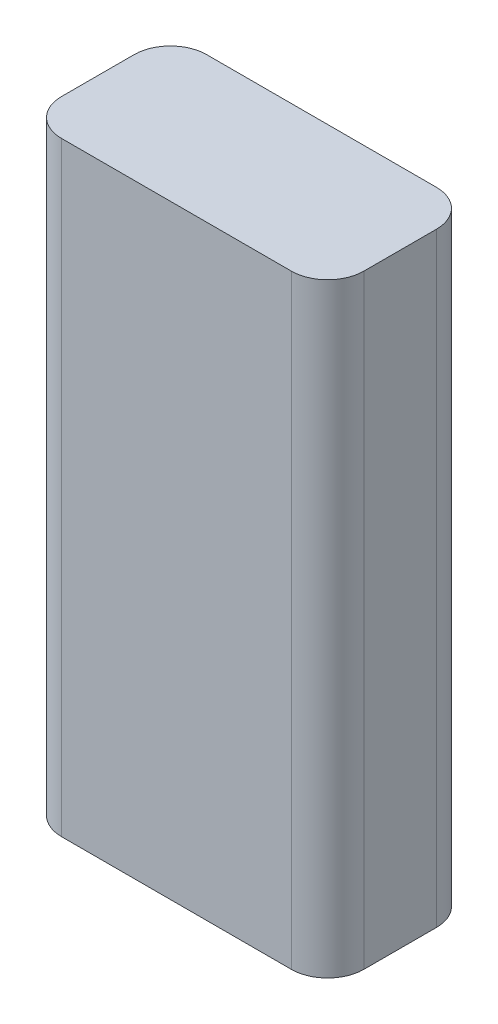
ISO-10303-21;
HEADER;
FILE_DESCRIPTION(('STEP AP214'),'2;1');
FILE_NAME('part.step','',(''),(''),'','','');
FILE_SCHEMA(('AUTOMOTIVE_DESIGN { 1 0 10303 214 1 1 1 1 }'));
ENDSEC;
DATA;
#1=APPLICATION_CONTEXT('core data for automotive mechanical design processes');
#2=APPLICATION_PROTOCOL_DEFINITION('international standard','automotive_design',2000,#1);
#3=PRODUCT_CONTEXT('',#1,'mechanical');
#4=PRODUCT('Part','Part','',(#3));
#5=PRODUCT_RELATED_PRODUCT_CATEGORY('part','',(#4));
#6=PRODUCT_DEFINITION_FORMATION('','',#4);
#7=PRODUCT_DEFINITION_CONTEXT('part definition',#1,'design');
#8=PRODUCT_DEFINITION('design','',#6,#7);
#9=PRODUCT_DEFINITION_SHAPE('','',#8);
#10=(LENGTH_UNIT() NAMED_UNIT(*) SI_UNIT(.MILLI.,.METRE.));
#11=(NAMED_UNIT(*) PLANE_ANGLE_UNIT() SI_UNIT($,.RADIAN.));
#12=(NAMED_UNIT(*) SI_UNIT($,.STERADIAN.) SOLID_ANGLE_UNIT());
#13=UNCERTAINTY_MEASURE_WITH_UNIT(LENGTH_MEASURE(1.E-05),#10,'distance_accuracy_value','');
#14=(GEOMETRIC_REPRESENTATION_CONTEXT(3) GLOBAL_UNCERTAINTY_ASSIGNED_CONTEXT((#13)) GLOBAL_UNIT_ASSIGNED_CONTEXT((#10,
#11,#12)) REPRESENTATION_CONTEXT('',''));
#15=CARTESIAN_POINT('',(0.,0.,0.));
#16=DIRECTION('',(0.,0.,1.));
#17=DIRECTION('',(1.,0.,0.));
#18=AXIS2_PLACEMENT_3D('',#15,#16,#17);
#19=CARTESIAN_POINT('',(0.,50.,0.));
#20=DIRECTION('',(1.,0.,0.));
#21=DIRECTION('',(0.,0.,-1.));
#22=AXIS2_PLACEMENT_3D('',#19,#20,#21);
#23=PLANE('',#22);
#24=DIRECTION('',(0.,0.,1.));
#25=VECTOR('',#24,1.);
#26=CARTESIAN_POINT('',(0.,50.,0.));
#27=LINE('',#26,#25);
#28=CARTESIAN_POINT('',(0.,50.,-9.));
#29=VERTEX_POINT('',#28);
#30=CARTESIAN_POINT('',(0.,50.,-3.));
#31=VERTEX_POINT('',#30);
#32=EDGE_CURVE('E132',#29,#31,#27,.T.);
#33=ORIENTED_EDGE('',*,*,#32,.F.);
#34=DIRECTION('',(0.,-1.,0.));
#35=VECTOR('',#34,1.);
#36=CARTESIAN_POINT('',(0.,50.,-9.));
#37=LINE('',#36,#35);
#38=CARTESIAN_POINT('',(0.,0.,-9.));
#39=VERTEX_POINT('',#38);
#40=EDGE_CURVE('E117',#29,#39,#37,.T.);
#41=ORIENTED_EDGE('',*,*,#40,.T.);
#42=DIRECTION('',(0.,0.,1.));
#43=VECTOR('',#42,1.);
#44=CARTESIAN_POINT('',(0.,0.,0.));
#45=LINE('',#44,#43);
#46=CARTESIAN_POINT('',(0.,0.,-3.));
#47=VERTEX_POINT('',#46);
#48=EDGE_CURVE('E129',#39,#47,#45,.T.);
#49=ORIENTED_EDGE('',*,*,#48,.T.);
#50=DIRECTION('',(0.,-1.,0.));
#51=VECTOR('',#50,1.);
#52=CARTESIAN_POINT('',(0.,50.,-3.));
#53=LINE('',#52,#51);
#54=EDGE_CURVE('E135',#47,#31,#53,.F.);
#55=ORIENTED_EDGE('',*,*,#54,.T.);
#56=EDGE_LOOP('',(#33,#41,#49,#55));
#57=FACE_BOUND('',#56,.T.);
#58=ADVANCED_FACE('F42',(#57),#23,.F.);
#59=CARTESIAN_POINT('',(0.,50.,0.));
#60=DIRECTION('',(0.,0.,-1.));
#61=DIRECTION('',(-1.,0.,0.));
#62=AXIS2_PLACEMENT_3D('',#59,#60,#61);
#63=PLANE('',#62);
#64=DIRECTION('',(1.,0.,0.));
#65=VECTOR('',#64,1.);
#66=CARTESIAN_POINT('',(0.,0.,0.));
#67=LINE('',#66,#65);
#68=CARTESIAN_POINT('',(3.,0.,0.));
#69=VERTEX_POINT('',#68);
#70=CARTESIAN_POINT('',(22.,0.,0.));
#71=VERTEX_POINT('',#70);
#72=EDGE_CURVE('E139',#69,#71,#67,.T.);
#73=ORIENTED_EDGE('',*,*,#72,.T.);
#74=DIRECTION('',(0.,-1.,0.));
#75=VECTOR('',#74,1.);
#76=CARTESIAN_POINT('',(22.,50.,0.));
#77=LINE('',#76,#75);
#78=CARTESIAN_POINT('',(22.,50.,0.));
#79=VERTEX_POINT('',#78);
#80=EDGE_CURVE('E11',#71,#79,#77,.F.);
#81=ORIENTED_EDGE('',*,*,#80,.T.);
#82=DIRECTION('',(1.,0.,0.));
#83=VECTOR('',#82,1.);
#84=CARTESIAN_POINT('',(0.,50.,0.));
#85=LINE('',#84,#83);
#86=CARTESIAN_POINT('',(3.,50.,0.));
#87=VERTEX_POINT('',#86);
#88=EDGE_CURVE('E182',#87,#79,#85,.T.);
#89=ORIENTED_EDGE('',*,*,#88,.F.);
#90=DIRECTION('',(0.,-1.,0.));
#91=VECTOR('',#90,1.);
#92=CARTESIAN_POINT('',(3.,50.,0.));
#93=LINE('',#92,#91);
#94=EDGE_CURVE('E50',#87,#69,#93,.T.);
#95=ORIENTED_EDGE('',*,*,#94,.T.);
#96=EDGE_LOOP('',(#73,#81,#89,#95));
#97=FACE_BOUND('',#96,.T.);
#98=ADVANCED_FACE('F180',(#97),#63,.F.);
#99=CARTESIAN_POINT('',(25.,50.,0.));
#100=DIRECTION('',(-1.,0.,0.));
#101=DIRECTION('',(0.,0.,1.));
#102=AXIS2_PLACEMENT_3D('',#99,#100,#101);
#103=PLANE('',#102);
#104=DIRECTION('',(0.,0.,-1.));
#105=VECTOR('',#104,1.);
#106=CARTESIAN_POINT('',(25.,0.,0.));
#107=LINE('',#106,#105);
#108=CARTESIAN_POINT('',(25.,0.,-3.));
#109=VERTEX_POINT('',#108);
#110=CARTESIAN_POINT('',(25.,0.,-9.));
#111=VERTEX_POINT('',#110);
#112=EDGE_CURVE('E142',#109,#111,#107,.T.);
#113=ORIENTED_EDGE('',*,*,#112,.T.);
#114=DIRECTION('',(0.,-1.,0.));
#115=VECTOR('',#114,1.);
#116=CARTESIAN_POINT('',(25.,50.,-9.));
#117=LINE('',#116,#115);
#118=CARTESIAN_POINT('',(25.,50.,-9.));
#119=VERTEX_POINT('',#118);
#120=EDGE_CURVE('E57',#111,#119,#117,.F.);
#121=ORIENTED_EDGE('',*,*,#120,.T.);
#122=DIRECTION('',(0.,0.,-1.));
#123=VECTOR('',#122,1.);
#124=CARTESIAN_POINT('',(25.,50.,0.));
#125=LINE('',#124,#123);
#126=CARTESIAN_POINT('',(25.,50.,-3.));
#127=VERTEX_POINT('',#126);
#128=EDGE_CURVE('E190',#127,#119,#125,.T.);
#129=ORIENTED_EDGE('',*,*,#128,.F.);
#130=DIRECTION('',(0.,-1.,0.));
#131=VECTOR('',#130,1.);
#132=CARTESIAN_POINT('',(25.,50.,-3.));
#133=LINE('',#132,#131);
#134=EDGE_CURVE('E172',#127,#109,#133,.T.);
#135=ORIENTED_EDGE('',*,*,#134,.T.);
#136=EDGE_LOOP('',(#113,#121,#129,#135));
#137=FACE_BOUND('',#136,.T.);
#138=ADVANCED_FACE('F189',(#137),#103,.F.);
#139=CARTESIAN_POINT('',(0.,50.,-12.));
#140=DIRECTION('',(0.,0.,1.));
#141=DIRECTION('',(1.,0.,0.));
#142=AXIS2_PLACEMENT_3D('',#139,#140,#141);
#143=PLANE('',#142);
#144=DIRECTION('',(-1.,0.,0.));
#145=VECTOR('',#144,1.);
#146=CARTESIAN_POINT('',(0.,0.,-12.));
#147=LINE('',#146,#145);
#148=CARTESIAN_POINT('',(22.,0.,-12.));
#149=VERTEX_POINT('',#148);
#150=CARTESIAN_POINT('',(3.,0.,-12.));
#151=VERTEX_POINT('',#150);
#152=EDGE_CURVE('E149',#149,#151,#147,.T.);
#153=ORIENTED_EDGE('',*,*,#152,.T.);
#154=DIRECTION('',(0.,-1.,0.));
#155=VECTOR('',#154,1.);
#156=CARTESIAN_POINT('',(3.,50.,-12.));
#157=LINE('',#156,#155);
#158=CARTESIAN_POINT('',(3.,50.,-12.));
#159=VERTEX_POINT('',#158);
#160=EDGE_CURVE('E118',#151,#159,#157,.F.);
#161=ORIENTED_EDGE('',*,*,#160,.T.);
#162=DIRECTION('',(-1.,0.,0.));
#163=VECTOR('',#162,1.);
#164=CARTESIAN_POINT('',(0.,50.,-12.));
#165=LINE('',#164,#163);
#166=CARTESIAN_POINT('',(22.,50.,-12.));
#167=VERTEX_POINT('',#166);
#168=EDGE_CURVE('E145',#167,#159,#165,.T.);
#169=ORIENTED_EDGE('',*,*,#168,.F.);
#170=DIRECTION('',(0.,-1.,0.));
#171=VECTOR('',#170,1.);
#172=CARTESIAN_POINT('',(22.,50.,-12.));
#173=LINE('',#172,#171);
#174=EDGE_CURVE('E123',#167,#149,#173,.T.);
#175=ORIENTED_EDGE('',*,*,#174,.T.);
#176=EDGE_LOOP('',(#153,#161,#169,#175));
#177=FACE_BOUND('',#176,.T.);
#178=ADVANCED_FACE('F221',(#177),#143,.F.);
#179=CARTESIAN_POINT('',(0.,50.,0.));
#180=DIRECTION('',(0.,-1.,0.));
#181=DIRECTION('',(0.,0.,-1.));
#182=AXIS2_PLACEMENT_3D('',#179,#180,#181);
#183=PLANE('',#182);
#184=ORIENTED_EDGE('',*,*,#168,.T.);
#185=CARTESIAN_POINT('',(3.,50.,-9.));
#186=DIRECTION('',(0.,-1.,0.));
#187=DIRECTION('',(0.,0.,-1.));
#188=AXIS2_PLACEMENT_3D('',#185,#186,#187);
#189=CIRCLE('',#188,3.);
#190=EDGE_CURVE('E169',#159,#29,#189,.F.);
#191=ORIENTED_EDGE('',*,*,#190,.T.);
#192=ORIENTED_EDGE('',*,*,#32,.T.);
#193=CARTESIAN_POINT('',(3.,50.,-3.));
#194=DIRECTION('',(0.,-1.,0.));
#195=DIRECTION('',(0.,0.,-1.));
#196=AXIS2_PLACEMENT_3D('',#193,#194,#195);
#197=CIRCLE('',#196,3.);
#198=EDGE_CURVE('E162',#31,#87,#197,.F.);
#199=ORIENTED_EDGE('',*,*,#198,.T.);
#200=ORIENTED_EDGE('',*,*,#88,.T.);
#201=CARTESIAN_POINT('',(22.,50.,-3.));
#202=DIRECTION('',(0.,-1.,0.));
#203=DIRECTION('',(0.,0.,-1.));
#204=AXIS2_PLACEMENT_3D('',#201,#202,#203);
#205=CIRCLE('',#204,3.);
#206=EDGE_CURVE('E64',#79,#127,#205,.F.);
#207=ORIENTED_EDGE('',*,*,#206,.T.);
#208=ORIENTED_EDGE('',*,*,#128,.T.);
#209=CARTESIAN_POINT('',(22.,50.,-9.));
#210=DIRECTION('',(0.,-1.,0.));
#211=DIRECTION('',(0.,0.,-1.));
#212=AXIS2_PLACEMENT_3D('',#209,#210,#211);
#213=CIRCLE('',#212,3.);
#214=EDGE_CURVE('E166',#119,#167,#213,.F.);
#215=ORIENTED_EDGE('',*,*,#214,.T.);
#216=EDGE_LOOP('',(#184,#191,#192,#199,#200,#207,#208,#215));
#217=FACE_BOUND('',#216,.T.);
#218=ADVANCED_FACE('F198',(#217),#183,.F.);
#219=CARTESIAN_POINT('',(0.,0.,0.));
#220=DIRECTION('',(0.,-1.,0.));
#221=DIRECTION('',(0.,0.,-1.));
#222=AXIS2_PLACEMENT_3D('',#219,#220,#221);
#223=PLANE('',#222);
#224=ORIENTED_EDGE('',*,*,#48,.F.);
#225=CARTESIAN_POINT('',(3.,0.,-9.));
#226=DIRECTION('',(0.,-1.,0.));
#227=DIRECTION('',(0.,0.,-1.));
#228=AXIS2_PLACEMENT_3D('',#225,#226,#227);
#229=CIRCLE('',#228,3.);
#230=EDGE_CURVE('E113',#39,#151,#229,.T.);
#231=ORIENTED_EDGE('',*,*,#230,.T.);
#232=ORIENTED_EDGE('',*,*,#152,.F.);
#233=CARTESIAN_POINT('',(22.,0.,-9.));
#234=DIRECTION('',(0.,-1.,0.));
#235=DIRECTION('',(0.,0.,-1.));
#236=AXIS2_PLACEMENT_3D('',#233,#234,#235);
#237=CIRCLE('',#236,3.);
#238=EDGE_CURVE('E124',#149,#111,#237,.T.);
#239=ORIENTED_EDGE('',*,*,#238,.T.);
#240=ORIENTED_EDGE('',*,*,#112,.F.);
#241=CARTESIAN_POINT('',(22.,0.,-3.));
#242=DIRECTION('',(0.,-1.,0.));
#243=DIRECTION('',(0.,0.,-1.));
#244=AXIS2_PLACEMENT_3D('',#241,#242,#243);
#245=CIRCLE('',#244,3.);
#246=EDGE_CURVE('E154',#109,#71,#245,.T.);
#247=ORIENTED_EDGE('',*,*,#246,.T.);
#248=ORIENTED_EDGE('',*,*,#72,.F.);
#249=CARTESIAN_POINT('',(3.,0.,-3.));
#250=DIRECTION('',(0.,-1.,0.));
#251=DIRECTION('',(0.,0.,-1.));
#252=AXIS2_PLACEMENT_3D('',#249,#250,#251);
#253=CIRCLE('',#252,3.);
#254=EDGE_CURVE('E134',#69,#47,#253,.T.);
#255=ORIENTED_EDGE('',*,*,#254,.T.);
#256=EDGE_LOOP('',(#224,#231,#232,#239,#240,#247,#248,#255));
#257=FACE_BOUND('',#256,.T.);
#258=ADVANCED_FACE('F137',(#257),#223,.T.);
#259=CARTESIAN_POINT('',(3.,50.,-9.));
#260=DIRECTION('',(0.,-1.,0.));
#261=DIRECTION('',(0.,0.,-1.));
#262=AXIS2_PLACEMENT_3D('',#259,#260,#261);
#263=CYLINDRICAL_SURFACE('',#262,3.);
#264=ORIENTED_EDGE('',*,*,#190,.F.);
#265=ORIENTED_EDGE('',*,*,#160,.F.);
#266=ORIENTED_EDGE('',*,*,#230,.F.);
#267=ORIENTED_EDGE('',*,*,#40,.F.);
#268=EDGE_LOOP('',(#264,#265,#266,#267));
#269=FACE_BOUND('',#268,.T.);
#270=ADVANCED_FACE('F116',(#269),#263,.T.);
#271=CARTESIAN_POINT('',(22.,50.,-9.));
#272=DIRECTION('',(0.,-1.,0.));
#273=DIRECTION('',(0.,0.,-1.));
#274=AXIS2_PLACEMENT_3D('',#271,#272,#273);
#275=CYLINDRICAL_SURFACE('',#274,3.);
#276=ORIENTED_EDGE('',*,*,#214,.F.);
#277=ORIENTED_EDGE('',*,*,#120,.F.);
#278=ORIENTED_EDGE('',*,*,#238,.F.);
#279=ORIENTED_EDGE('',*,*,#174,.F.);
#280=EDGE_LOOP('',(#276,#277,#278,#279));
#281=FACE_BOUND('',#280,.T.);
#282=ADVANCED_FACE('F203',(#281),#275,.T.);
#283=CARTESIAN_POINT('',(22.,50.,-3.));
#284=DIRECTION('',(0.,-1.,0.));
#285=DIRECTION('',(0.,0.,-1.));
#286=AXIS2_PLACEMENT_3D('',#283,#284,#285);
#287=CYLINDRICAL_SURFACE('',#286,3.);
#288=ORIENTED_EDGE('',*,*,#206,.F.);
#289=ORIENTED_EDGE('',*,*,#80,.F.);
#290=ORIENTED_EDGE('',*,*,#246,.F.);
#291=ORIENTED_EDGE('',*,*,#134,.F.);
#292=EDGE_LOOP('',(#288,#289,#290,#291));
#293=FACE_BOUND('',#292,.T.);
#294=ADVANCED_FACE('F188',(#293),#287,.T.);
#295=CARTESIAN_POINT('',(3.,50.,-3.));
#296=DIRECTION('',(0.,-1.,0.));
#297=DIRECTION('',(0.,0.,-1.));
#298=AXIS2_PLACEMENT_3D('',#295,#296,#297);
#299=CYLINDRICAL_SURFACE('',#298,3.);
#300=ORIENTED_EDGE('',*,*,#198,.F.);
#301=ORIENTED_EDGE('',*,*,#54,.F.);
#302=ORIENTED_EDGE('',*,*,#254,.F.);
#303=ORIENTED_EDGE('',*,*,#94,.F.);
#304=EDGE_LOOP('',(#300,#301,#302,#303));
#305=FACE_BOUND('',#304,.T.);
#306=ADVANCED_FACE('F44',(#305),#299,.T.);
#307=CLOSED_SHELL('',(#58,#98,#138,#178,#218,#258,#270,#282,#294,#306));
#308=MANIFOLD_SOLID_BREP('B2',#307);
#309=ADVANCED_BREP_SHAPE_REPRESENTATION('',(#18,#308),#14);
#310=SHAPE_DEFINITION_REPRESENTATION(#9,#309);
ENDSEC;
END-ISO-10303-21;
